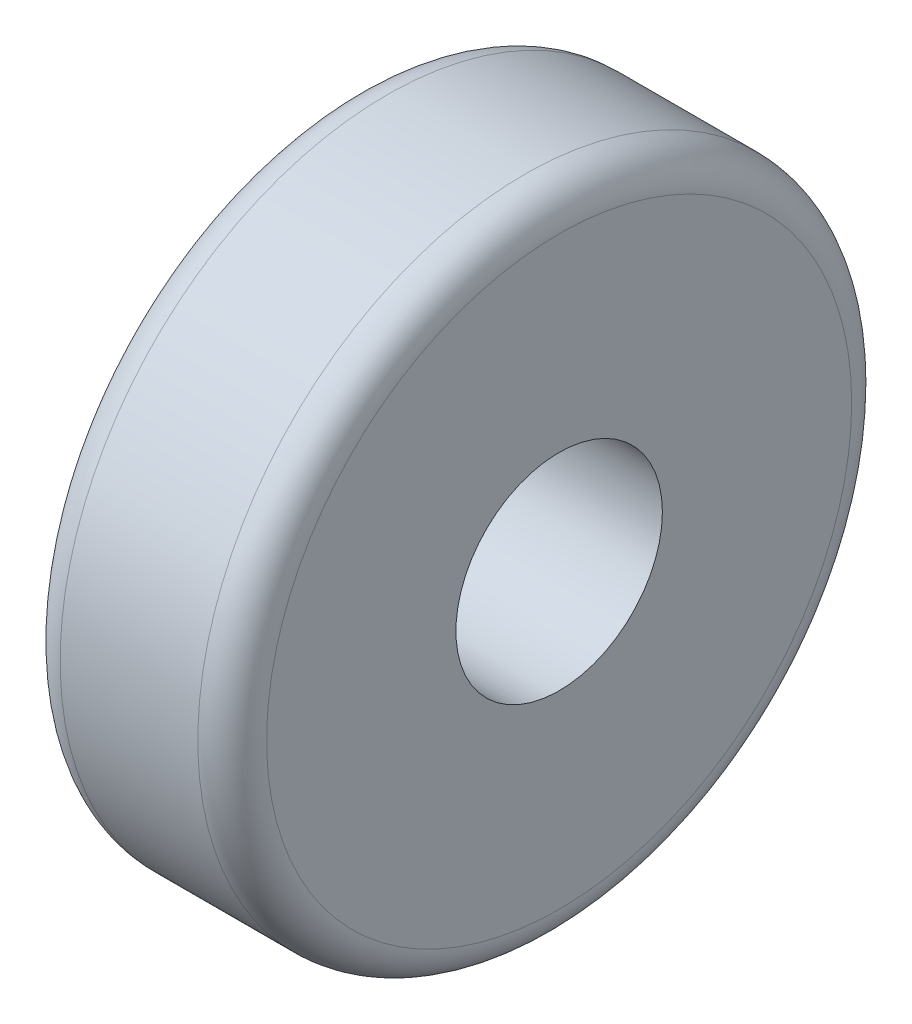
ISO-10303-21;
HEADER;
FILE_DESCRIPTION(('STEP AP214'),'2;1');
FILE_NAME('part.step','',(''),(''),'','','');
FILE_SCHEMA(('AUTOMOTIVE_DESIGN { 1 0 10303 214 1 1 1 1 }'));
ENDSEC;
DATA;
#1=APPLICATION_CONTEXT('core data for automotive mechanical design processes');
#2=APPLICATION_PROTOCOL_DEFINITION('international standard','automotive_design',2000,#1);
#3=PRODUCT_CONTEXT('',#1,'mechanical');
#4=PRODUCT('Part','Part','',(#3));
#5=PRODUCT_RELATED_PRODUCT_CATEGORY('part','',(#4));
#6=PRODUCT_DEFINITION_FORMATION('','',#4);
#7=PRODUCT_DEFINITION_CONTEXT('part definition',#1,'design');
#8=PRODUCT_DEFINITION('design','',#6,#7);
#9=PRODUCT_DEFINITION_SHAPE('','',#8);
#10=(LENGTH_UNIT() NAMED_UNIT(*) SI_UNIT(.MILLI.,.METRE.));
#11=(NAMED_UNIT(*) PLANE_ANGLE_UNIT() SI_UNIT($,.RADIAN.));
#12=(NAMED_UNIT(*) SI_UNIT($,.STERADIAN.) SOLID_ANGLE_UNIT());
#13=UNCERTAINTY_MEASURE_WITH_UNIT(LENGTH_MEASURE(1.E-05),#10,'distance_accuracy_value','');
#14=(GEOMETRIC_REPRESENTATION_CONTEXT(3) GLOBAL_UNCERTAINTY_ASSIGNED_CONTEXT((#13)) GLOBAL_UNIT_ASSIGNED_CONTEXT((#10,
#11,#12)) REPRESENTATION_CONTEXT('',''));
#15=CARTESIAN_POINT('',(0.,0.,0.));
#16=DIRECTION('',(0.,0.,1.));
#17=DIRECTION('',(1.,0.,0.));
#18=AXIS2_PLACEMENT_3D('',#15,#16,#17);
#19=CARTESIAN_POINT('',(6.,0.,0.));
#20=DIRECTION('',(1.,0.,0.));
#21=DIRECTION('',(0.,0.,-1.));
#22=AXIS2_PLACEMENT_3D('',#19,#20,#21);
#23=PLANE('',#22);
#24=CARTESIAN_POINT('',(6.,0.,0.));
#25=DIRECTION('',(1.,0.,0.));
#26=DIRECTION('',(0.,0.,-1.));
#27=AXIS2_PLACEMENT_3D('',#24,#25,#26);
#28=CIRCLE('',#27,8.5);
#29=CARTESIAN_POINT('',(6.,0.,-8.5));
#30=VERTEX_POINT('',#29);
#31=EDGE_CURVE('E10',#30,#30,#28,.T.);
#32=ORIENTED_EDGE('',*,*,#31,.T.);
#33=EDGE_LOOP('',(#32));
#34=FACE_BOUND('',#33,.T.);
#35=CARTESIAN_POINT('',(6.,0.,0.));
#36=DIRECTION('',(1.,0.,0.));
#37=DIRECTION('',(0.,0.,-1.));
#38=AXIS2_PLACEMENT_3D('',#35,#36,#37);
#39=CIRCLE('',#38,3.);
#40=CARTESIAN_POINT('',(6.,0.,-3.));
#41=VERTEX_POINT('',#40);
#42=EDGE_CURVE('E52',#41,#41,#39,.T.);
#43=ORIENTED_EDGE('',*,*,#42,.F.);
#44=EDGE_LOOP('',(#43));
#45=FACE_BOUND('',#44,.T.);
#46=ADVANCED_FACE('F32',(#34,#45),#23,.T.);
#47=CARTESIAN_POINT('',(0.,0.,0.));
#48=DIRECTION('',(1.,0.,0.));
#49=DIRECTION('',(0.,0.,-1.));
#50=AXIS2_PLACEMENT_3D('',#47,#48,#49);
#51=PLANE('',#50);
#52=CARTESIAN_POINT('',(0.,0.,0.));
#53=DIRECTION('',(1.,0.,0.));
#54=DIRECTION('',(0.,0.,-1.));
#55=AXIS2_PLACEMENT_3D('',#52,#53,#54);
#56=CIRCLE('',#55,8.5);
#57=CARTESIAN_POINT('',(0.,0.,-8.5));
#58=VERTEX_POINT('',#57);
#59=EDGE_CURVE('E39',#58,#58,#56,.F.);
#60=ORIENTED_EDGE('',*,*,#59,.T.);
#61=EDGE_LOOP('',(#60));
#62=FACE_BOUND('',#61,.T.);
#63=CARTESIAN_POINT('',(0.,0.,0.));
#64=DIRECTION('',(1.,0.,0.));
#65=DIRECTION('',(0.,0.,-1.));
#66=AXIS2_PLACEMENT_3D('',#63,#64,#65);
#67=CIRCLE('',#66,3.);
#68=CARTESIAN_POINT('',(0.,0.,-3.));
#69=VERTEX_POINT('',#68);
#70=EDGE_CURVE('E53',#69,#69,#67,.T.);
#71=ORIENTED_EDGE('',*,*,#70,.T.);
#72=EDGE_LOOP('',(#71));
#73=FACE_BOUND('',#72,.T.);
#74=ADVANCED_FACE('F63',(#62,#73),#51,.F.);
#75=CARTESIAN_POINT('',(6.,0.,0.));
#76=DIRECTION('',(-1.,0.,0.));
#77=DIRECTION('',(0.,0.,1.));
#78=AXIS2_PLACEMENT_3D('',#75,#76,#77);
#79=CYLINDRICAL_SURFACE('',#78,9.5);
#80=CARTESIAN_POINT('',(1.,0.,0.));
#81=DIRECTION('',(1.,0.,0.));
#82=DIRECTION('',(0.,0.,-1.));
#83=AXIS2_PLACEMENT_3D('',#80,#81,#82);
#84=CIRCLE('',#83,9.5);
#85=CARTESIAN_POINT('',(1.,0.,-9.5));
#86=VERTEX_POINT('',#85);
#87=EDGE_CURVE('E43',#86,#86,#84,.T.);
#88=ORIENTED_EDGE('',*,*,#87,.T.);
#89=EDGE_LOOP('',(#88));
#90=FACE_BOUND('',#89,.T.);
#91=CARTESIAN_POINT('',(5.,0.,0.));
#92=DIRECTION('',(1.,0.,0.));
#93=DIRECTION('',(0.,0.,-1.));
#94=AXIS2_PLACEMENT_3D('',#91,#92,#93);
#95=CIRCLE('',#94,9.5);
#96=CARTESIAN_POINT('',(5.,0.,-9.5));
#97=VERTEX_POINT('',#96);
#98=EDGE_CURVE('E47',#97,#97,#95,.F.);
#99=ORIENTED_EDGE('',*,*,#98,.T.);
#100=EDGE_LOOP('',(#99));
#101=FACE_BOUND('',#100,.T.);
#102=ADVANCED_FACE('F68',(#90,#101),#79,.T.);
#103=CARTESIAN_POINT('',(6.,0.,0.));
#104=DIRECTION('',(-1.,0.,0.));
#105=DIRECTION('',(0.,0.,1.));
#106=AXIS2_PLACEMENT_3D('',#103,#104,#105);
#107=CYLINDRICAL_SURFACE('',#106,3.);
#108=ORIENTED_EDGE('',*,*,#42,.T.);
#109=EDGE_LOOP('',(#108));
#110=FACE_BOUND('',#109,.T.);
#111=ORIENTED_EDGE('',*,*,#70,.F.);
#112=EDGE_LOOP('',(#111));
#113=FACE_BOUND('',#112,.T.);
#114=ADVANCED_FACE('F59',(#110,#113),#107,.F.);
#115=CARTESIAN_POINT('',(1.,0.,0.));
#116=DIRECTION('',(1.,0.,0.));
#117=DIRECTION('',(0.,0.,-1.));
#118=AXIS2_PLACEMENT_3D('',#115,#116,#117);
#119=TOROIDAL_SURFACE('',#118,8.5,1.);
#120=ORIENTED_EDGE('',*,*,#59,.F.);
#121=EDGE_LOOP('',(#120));
#122=FACE_BOUND('',#121,.T.);
#123=ORIENTED_EDGE('',*,*,#87,.F.);
#124=EDGE_LOOP('',(#123));
#125=FACE_BOUND('',#124,.T.);
#126=ADVANCED_FACE('F74',(#122,#125),#119,.T.);
#127=CARTESIAN_POINT('',(5.,0.,0.));
#128=DIRECTION('',(1.,0.,0.));
#129=DIRECTION('',(0.,0.,-1.));
#130=AXIS2_PLACEMENT_3D('',#127,#128,#129);
#131=TOROIDAL_SURFACE('',#130,8.5,1.);
#132=ORIENTED_EDGE('',*,*,#98,.F.);
#133=EDGE_LOOP('',(#132));
#134=FACE_BOUND('',#133,.T.);
#135=ORIENTED_EDGE('',*,*,#31,.F.);
#136=EDGE_LOOP('',(#135));
#137=FACE_BOUND('',#136,.T.);
#138=ADVANCED_FACE('F34',(#134,#137),#131,.T.);
#139=CLOSED_SHELL('',(#46,#74,#102,#114,#126,#138));
#140=MANIFOLD_SOLID_BREP('B2',#139);
#141=ADVANCED_BREP_SHAPE_REPRESENTATION('',(#18,#140),#14);
#142=SHAPE_DEFINITION_REPRESENTATION(#9,#141);
ENDSEC;
END-ISO-10303-21;
